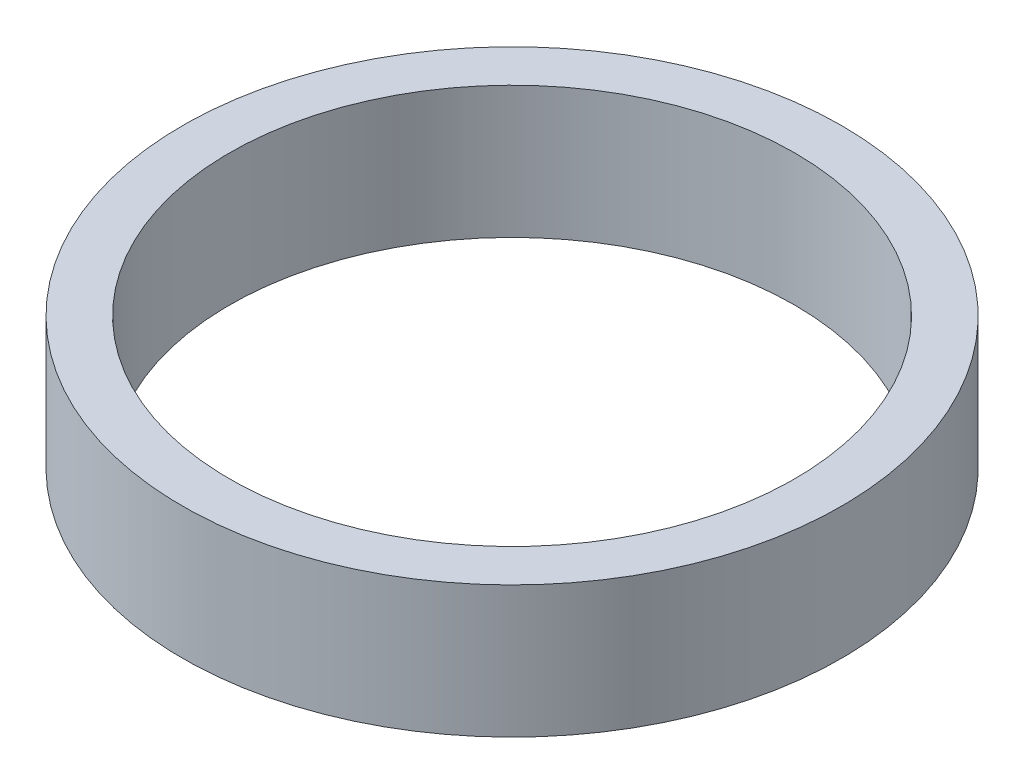
ISO-10303-21;
HEADER;
FILE_DESCRIPTION(('STEP AP214'),'2;1');
FILE_NAME('part.step','',(''),(''),'','','');
FILE_SCHEMA(('AUTOMOTIVE_DESIGN { 1 0 10303 214 1 1 1 1 }'));
ENDSEC;
DATA;
#1=APPLICATION_CONTEXT('core data for automotive mechanical design processes');
#2=APPLICATION_PROTOCOL_DEFINITION('international standard','automotive_design',2000,#1);
#3=PRODUCT_CONTEXT('',#1,'mechanical');
#4=PRODUCT('Part','Part','',(#3));
#5=PRODUCT_RELATED_PRODUCT_CATEGORY('part','',(#4));
#6=PRODUCT_DEFINITION_FORMATION('','',#4);
#7=PRODUCT_DEFINITION_CONTEXT('part definition',#1,'design');
#8=PRODUCT_DEFINITION('design','',#6,#7);
#9=PRODUCT_DEFINITION_SHAPE('','',#8);
#10=(LENGTH_UNIT() NAMED_UNIT(*) SI_UNIT(.MILLI.,.METRE.));
#11=(NAMED_UNIT(*) PLANE_ANGLE_UNIT() SI_UNIT($,.RADIAN.));
#12=(NAMED_UNIT(*) SI_UNIT($,.STERADIAN.) SOLID_ANGLE_UNIT());
#13=UNCERTAINTY_MEASURE_WITH_UNIT(LENGTH_MEASURE(1.E-05),#10,'distance_accuracy_value','');
#14=(GEOMETRIC_REPRESENTATION_CONTEXT(3) GLOBAL_UNCERTAINTY_ASSIGNED_CONTEXT((#13)) GLOBAL_UNIT_ASSIGNED_CONTEXT((#10,
#11,#12)) REPRESENTATION_CONTEXT('',''));
#15=CARTESIAN_POINT('',(0.,0.,0.));
#16=DIRECTION('',(0.,0.,1.));
#17=DIRECTION('',(1.,0.,0.));
#18=AXIS2_PLACEMENT_3D('',#15,#16,#17);
#19=CARTESIAN_POINT('',(0.,21.,0.));
#20=DIRECTION('',(0.,-1.,0.));
#21=DIRECTION('',(0.,0.,-1.));
#22=AXIS2_PLACEMENT_3D('',#19,#20,#21);
#23=CYLINDRICAL_SURFACE('',#22,52.5);
#24=CARTESIAN_POINT('',(0.,21.,0.));
#25=DIRECTION('',(0.,1.,0.));
#26=DIRECTION('',(0.,0.,1.));
#27=AXIS2_PLACEMENT_3D('',#24,#25,#26);
#28=CIRCLE('',#27,52.5);
#29=CARTESIAN_POINT('',(0.,21.,-52.5));
#30=VERTEX_POINT('',#29);
#31=EDGE_CURVE('E10',#30,#30,#28,.T.);
#32=CARTESIAN_POINT('',(0.,0.,0.));
#33=DIRECTION('',(0.,1.,0.));
#34=DIRECTION('',(0.,0.,1.));
#35=AXIS2_PLACEMENT_3D('',#32,#33,#34);
#36=CIRCLE('',#35,52.5);
#37=CARTESIAN_POINT('',(0.,0.,-52.5));
#38=VERTEX_POINT('',#37);
#39=EDGE_CURVE('E37',#38,#38,#36,.T.);
#40=CARTESIAN_POINT('',(0.,21.,-52.5));
#41=CARTESIAN_POINT('',(0.,20.78125,-52.5));
#42=CARTESIAN_POINT('',(0.,20.5625,-52.5));
#43=CARTESIAN_POINT('',(0.,20.125,-52.5));
#44=CARTESIAN_POINT('',(0.,19.90625,-52.5));
#45=CARTESIAN_POINT('',(0.,19.46875,-52.5));
#46=CARTESIAN_POINT('',(0.,19.25,-52.5));
#47=CARTESIAN_POINT('',(0.,18.8125,-52.5));
#48=CARTESIAN_POINT('',(0.,18.59375,-52.5));
#49=CARTESIAN_POINT('',(0.,18.15625,-52.5));
#50=CARTESIAN_POINT('',(0.,17.9375,-52.5));
#51=CARTESIAN_POINT('',(0.,17.5,-52.5));
#52=CARTESIAN_POINT('',(0.,17.28125,-52.5));
#53=CARTESIAN_POINT('',(0.,16.84375,-52.5));
#54=CARTESIAN_POINT('',(0.,16.625,-52.5));
#55=CARTESIAN_POINT('',(0.,16.1875,-52.5));
#56=CARTESIAN_POINT('',(0.,15.96875,-52.5));
#57=CARTESIAN_POINT('',(0.,15.53125,-52.5));
#58=CARTESIAN_POINT('',(0.,15.3125,-52.5));
#59=CARTESIAN_POINT('',(0.,14.875,-52.5));
#60=CARTESIAN_POINT('',(0.,14.65625,-52.5));
#61=CARTESIAN_POINT('',(0.,14.21875,-52.5));
#62=CARTESIAN_POINT('',(0.,14.,-52.5));
#63=CARTESIAN_POINT('',(0.,13.5625,-52.5));
#64=CARTESIAN_POINT('',(0.,13.34375,-52.5));
#65=CARTESIAN_POINT('',(0.,12.90625,-52.5));
#66=CARTESIAN_POINT('',(0.,12.6875,-52.5));
#67=CARTESIAN_POINT('',(0.,12.25,-52.5));
#68=CARTESIAN_POINT('',(0.,12.03125,-52.5));
#69=CARTESIAN_POINT('',(0.,11.59375,-52.5));
#70=CARTESIAN_POINT('',(0.,11.375,-52.5));
#71=CARTESIAN_POINT('',(0.,10.9375,-52.5));
#72=CARTESIAN_POINT('',(0.,10.71875,-52.5));
#73=CARTESIAN_POINT('',(0.,10.28125,-52.5));
#74=CARTESIAN_POINT('',(0.,10.0625,-52.5));
#75=CARTESIAN_POINT('',(0.,9.625,-52.5));
#76=CARTESIAN_POINT('',(0.,9.40625,-52.5));
#77=CARTESIAN_POINT('',(0.,8.96875,-52.5));
#78=CARTESIAN_POINT('',(0.,8.75,-52.5));
#79=CARTESIAN_POINT('',(0.,8.3125,-52.5));
#80=CARTESIAN_POINT('',(0.,8.09375,-52.5));
#81=CARTESIAN_POINT('',(0.,7.65625,-52.5));
#82=CARTESIAN_POINT('',(0.,7.4375,-52.5));
#83=CARTESIAN_POINT('',(0.,7.,-52.5));
#84=CARTESIAN_POINT('',(0.,6.78125,-52.5));
#85=CARTESIAN_POINT('',(0.,6.34375,-52.5));
#86=CARTESIAN_POINT('',(0.,6.125,-52.5));
#87=CARTESIAN_POINT('',(0.,5.6875,-52.5));
#88=CARTESIAN_POINT('',(0.,5.46875,-52.5));
#89=CARTESIAN_POINT('',(0.,5.03125,-52.5));
#90=CARTESIAN_POINT('',(0.,4.8125,-52.5));
#91=CARTESIAN_POINT('',(0.,4.375,-52.5));
#92=CARTESIAN_POINT('',(0.,4.15625,-52.5));
#93=CARTESIAN_POINT('',(0.,3.71875,-52.5));
#94=CARTESIAN_POINT('',(0.,3.5,-52.5));
#95=CARTESIAN_POINT('',(0.,3.0625,-52.5));
#96=CARTESIAN_POINT('',(0.,2.84375,-52.5));
#97=CARTESIAN_POINT('',(0.,2.40625,-52.5));
#98=CARTESIAN_POINT('',(0.,2.1875,-52.5));
#99=CARTESIAN_POINT('',(0.,1.75,-52.5));
#100=CARTESIAN_POINT('',(0.,1.53125,-52.5));
#101=CARTESIAN_POINT('',(0.,1.09375,-52.5));
#102=CARTESIAN_POINT('',(0.,0.875000000000001,-52.5));
#103=CARTESIAN_POINT('',(0.,0.4375,-52.5));
#104=CARTESIAN_POINT('',(0.,0.21875,-52.5));
#105=CARTESIAN_POINT('',(0.,0.,-52.5));
#106=B_SPLINE_CURVE_WITH_KNOTS('',3,(#40,#41,#42,#43,#44,#45,#46,#47,#48,#49,#50,#51,#52,#53,
#54,#55,#56,#57,#58,#59,#60,#61,#62,#63,#64,#65,#66,#67,#68,#69,#70,#71,#72,#73,#74,#75,#76,#77,
#78,#79,#80,#81,#82,#83,#84,#85,#86,#87,#88,#89,#90,#91,#92,#93,#94,#95,#96,#97,#98,#99,#100,
#101,#102,#103,#104,#105),.UNSPECIFIED.,.F.,.F.,(4,2,2,2,2,2,2,2,2,2,2,2,2,2,2,2,2,2,2,2,2,2,2,
2,2,2,2,2,2,2,2,2,4),(0.,0.656249999999997,1.3125,1.96875,2.625,3.28125,3.9375,4.59375,5.25,
5.90625,6.5625,7.21875,7.875,8.53125,9.1875,9.84375,10.5,11.15625,11.8125,12.46875,13.125,
13.78125,14.4375,15.09375,15.75,16.40625,17.0625,17.71875,18.375,19.03125,19.6875,20.34375,21.),.UNSPECIFIED.);
#107=EDGE_CURVE('BSEAM40',#30,#38,#106,.T.);
#108=ORIENTED_EDGE('',*,*,#31,.F.);
#109=ORIENTED_EDGE('',*,*,#39,.T.);
#110=ORIENTED_EDGE('',*,*,#107,.T.);
#111=ORIENTED_EDGE('',*,*,#107,.F.);
#112=EDGE_LOOP('',(#108,#110,#109,#111));
#113=FACE_BOUND('',#112,.T.);
#114=ADVANCED_FACE('F40',(#113),#23,.T.);
#115=CARTESIAN_POINT('',(0.,21.,0.));
#116=DIRECTION('',(0.,1.,0.));
#117=DIRECTION('',(0.,0.,1.));
#118=AXIS2_PLACEMENT_3D('',#115,#116,#117);
#119=PLANE('',#118);
#120=CARTESIAN_POINT('',(0.,21.,0.));
#121=DIRECTION('',(0.,1.,0.));
#122=DIRECTION('',(0.,0.,1.));
#123=AXIS2_PLACEMENT_3D('',#120,#121,#122);
#124=CIRCLE('',#123,45.);
#125=CARTESIAN_POINT('',(0.,21.,-45.));
#126=VERTEX_POINT('',#125);
#127=EDGE_CURVE('E50',#126,#126,#124,.T.);
#128=ORIENTED_EDGE('',*,*,#127,.F.);
#129=EDGE_LOOP('',(#128));
#130=FACE_BOUND('',#129,.T.);
#131=ORIENTED_EDGE('',*,*,#31,.T.);
#132=EDGE_LOOP('',(#131));
#133=FACE_BOUND('',#132,.T.);
#134=ADVANCED_FACE('F59',(#130,#133),#119,.T.);
#135=CARTESIAN_POINT('',(0.,0.,0.));
#136=DIRECTION('',(0.,1.,0.));
#137=DIRECTION('',(0.,0.,1.));
#138=AXIS2_PLACEMENT_3D('',#135,#136,#137);
#139=PLANE('',#138);
#140=CARTESIAN_POINT('',(0.,0.,0.));
#141=DIRECTION('',(0.,1.,0.));
#142=DIRECTION('',(0.,0.,1.));
#143=AXIS2_PLACEMENT_3D('',#140,#141,#142);
#144=CIRCLE('',#143,45.);
#145=CARTESIAN_POINT('',(0.,0.,-45.));
#146=VERTEX_POINT('',#145);
#147=EDGE_CURVE('E47',#146,#146,#144,.T.);
#148=ORIENTED_EDGE('',*,*,#147,.T.);
#149=EDGE_LOOP('',(#148));
#150=FACE_BOUND('',#149,.T.);
#151=ORIENTED_EDGE('',*,*,#39,.F.);
#152=EDGE_LOOP('',(#151));
#153=FACE_BOUND('',#152,.T.);
#154=ADVANCED_FACE('F58',(#150,#153),#139,.F.);
#155=CARTESIAN_POINT('',(0.,21.,0.));
#156=DIRECTION('',(0.,-1.,0.));
#157=DIRECTION('',(0.,0.,-1.));
#158=AXIS2_PLACEMENT_3D('',#155,#156,#157);
#159=CYLINDRICAL_SURFACE('',#158,45.);
#160=CARTESIAN_POINT('',(0.,21.,-45.));
#161=CARTESIAN_POINT('',(0.,20.78125,-45.));
#162=CARTESIAN_POINT('',(0.,20.5625,-45.));
#163=CARTESIAN_POINT('',(0.,20.125,-45.));
#164=CARTESIAN_POINT('',(0.,19.90625,-45.));
#165=CARTESIAN_POINT('',(0.,19.46875,-45.));
#166=CARTESIAN_POINT('',(0.,19.25,-45.));
#167=CARTESIAN_POINT('',(0.,18.8125,-45.));
#168=CARTESIAN_POINT('',(0.,18.59375,-45.));
#169=CARTESIAN_POINT('',(0.,18.15625,-45.));
#170=CARTESIAN_POINT('',(0.,17.9375,-45.));
#171=CARTESIAN_POINT('',(0.,17.5,-45.));
#172=CARTESIAN_POINT('',(0.,17.28125,-45.));
#173=CARTESIAN_POINT('',(0.,16.84375,-45.));
#174=CARTESIAN_POINT('',(0.,16.625,-45.));
#175=CARTESIAN_POINT('',(0.,16.1875,-45.));
#176=CARTESIAN_POINT('',(0.,15.96875,-45.));
#177=CARTESIAN_POINT('',(0.,15.53125,-45.));
#178=CARTESIAN_POINT('',(0.,15.3125,-45.));
#179=CARTESIAN_POINT('',(0.,14.875,-45.));
#180=CARTESIAN_POINT('',(0.,14.65625,-45.));
#181=CARTESIAN_POINT('',(0.,14.21875,-45.));
#182=CARTESIAN_POINT('',(0.,14.,-45.));
#183=CARTESIAN_POINT('',(0.,13.5625,-45.));
#184=CARTESIAN_POINT('',(0.,13.34375,-45.));
#185=CARTESIAN_POINT('',(0.,12.90625,-45.));
#186=CARTESIAN_POINT('',(0.,12.6875,-45.));
#187=CARTESIAN_POINT('',(0.,12.25,-45.));
#188=CARTESIAN_POINT('',(0.,12.03125,-45.));
#189=CARTESIAN_POINT('',(0.,11.59375,-45.));
#190=CARTESIAN_POINT('',(0.,11.375,-45.));
#191=CARTESIAN_POINT('',(0.,10.9375,-45.));
#192=CARTESIAN_POINT('',(0.,10.71875,-45.));
#193=CARTESIAN_POINT('',(0.,10.28125,-45.));
#194=CARTESIAN_POINT('',(0.,10.0625,-45.));
#195=CARTESIAN_POINT('',(0.,9.625,-45.));
#196=CARTESIAN_POINT('',(0.,9.40625,-45.));
#197=CARTESIAN_POINT('',(0.,8.96875,-45.));
#198=CARTESIAN_POINT('',(0.,8.75,-45.));
#199=CARTESIAN_POINT('',(0.,8.3125,-45.));
#200=CARTESIAN_POINT('',(0.,8.09375,-45.));
#201=CARTESIAN_POINT('',(0.,7.65625,-45.));
#202=CARTESIAN_POINT('',(0.,7.4375,-45.));
#203=CARTESIAN_POINT('',(0.,7.,-45.));
#204=CARTESIAN_POINT('',(0.,6.78125,-45.));
#205=CARTESIAN_POINT('',(0.,6.34375,-45.));
#206=CARTESIAN_POINT('',(0.,6.125,-45.));
#207=CARTESIAN_POINT('',(0.,5.6875,-45.));
#208=CARTESIAN_POINT('',(0.,5.46875,-45.));
#209=CARTESIAN_POINT('',(0.,5.03125,-45.));
#210=CARTESIAN_POINT('',(0.,4.8125,-45.));
#211=CARTESIAN_POINT('',(0.,4.375,-45.));
#212=CARTESIAN_POINT('',(0.,4.15625,-45.));
#213=CARTESIAN_POINT('',(0.,3.71875,-45.));
#214=CARTESIAN_POINT('',(0.,3.5,-45.));
#215=CARTESIAN_POINT('',(0.,3.0625,-45.));
#216=CARTESIAN_POINT('',(0.,2.84375,-45.));
#217=CARTESIAN_POINT('',(0.,2.40625,-45.));
#218=CARTESIAN_POINT('',(0.,2.1875,-45.));
#219=CARTESIAN_POINT('',(0.,1.75,-45.));
#220=CARTESIAN_POINT('',(0.,1.53125,-45.));
#221=CARTESIAN_POINT('',(0.,1.09375,-45.));
#222=CARTESIAN_POINT('',(0.,0.875000000000001,-45.));
#223=CARTESIAN_POINT('',(0.,0.4375,-45.));
#224=CARTESIAN_POINT('',(0.,0.21875,-45.));
#225=CARTESIAN_POINT('',(0.,0.,-45.));
#226=B_SPLINE_CURVE_WITH_KNOTS('',3,(#160,#161,#162,#163,#164,#165,#166,#167,#168,#169,#170,
#171,#172,#173,#174,#175,#176,#177,#178,#179,#180,#181,#182,#183,#184,#185,#186,#187,#188,#189,
#190,#191,#192,#193,#194,#195,#196,#197,#198,#199,#200,#201,#202,#203,#204,#205,#206,#207,#208,
#209,#210,#211,#212,#213,#214,#215,#216,#217,#218,#219,#220,#221,#222,#223,#224,#225),
.UNSPECIFIED.,.F.,.F.,(4,2,2,2,2,2,2,2,2,2,2,2,2,2,2,2,2,2,2,2,2,2,2,2,2,2,2,2,2,2,2,2,4),(0.,
0.656250000000001,1.3125,1.96875,2.625,3.28125,3.9375,4.59375,5.25,5.90625,6.5625,7.21875,7.875,
8.53125,9.1875,9.84375,10.5,11.15625,11.8125,12.46875,13.125,13.78125,14.4375,15.09375,15.75,
16.40625,17.0625,17.71875,18.375,19.03125,19.6875,20.34375,21.),.UNSPECIFIED.);
#227=EDGE_CURVE('BSEAM54',#126,#146,#226,.T.);
#228=ORIENTED_EDGE('',*,*,#127,.T.);
#229=ORIENTED_EDGE('',*,*,#147,.F.);
#230=ORIENTED_EDGE('',*,*,#227,.T.);
#231=ORIENTED_EDGE('',*,*,#227,.F.);
#232=EDGE_LOOP('',(#228,#230,#229,#231));
#233=FACE_BOUND('',#232,.T.);
#234=ADVANCED_FACE('F54',(#233),#159,.F.);
#235=CLOSED_SHELL('',(#114,#134,#154,#234));
#236=MANIFOLD_SOLID_BREP('B2',#235);
#237=ADVANCED_BREP_SHAPE_REPRESENTATION('',(#18,#236),#14);
#238=SHAPE_DEFINITION_REPRESENTATION(#9,#237);
ENDSEC;
END-ISO-10303-21;
